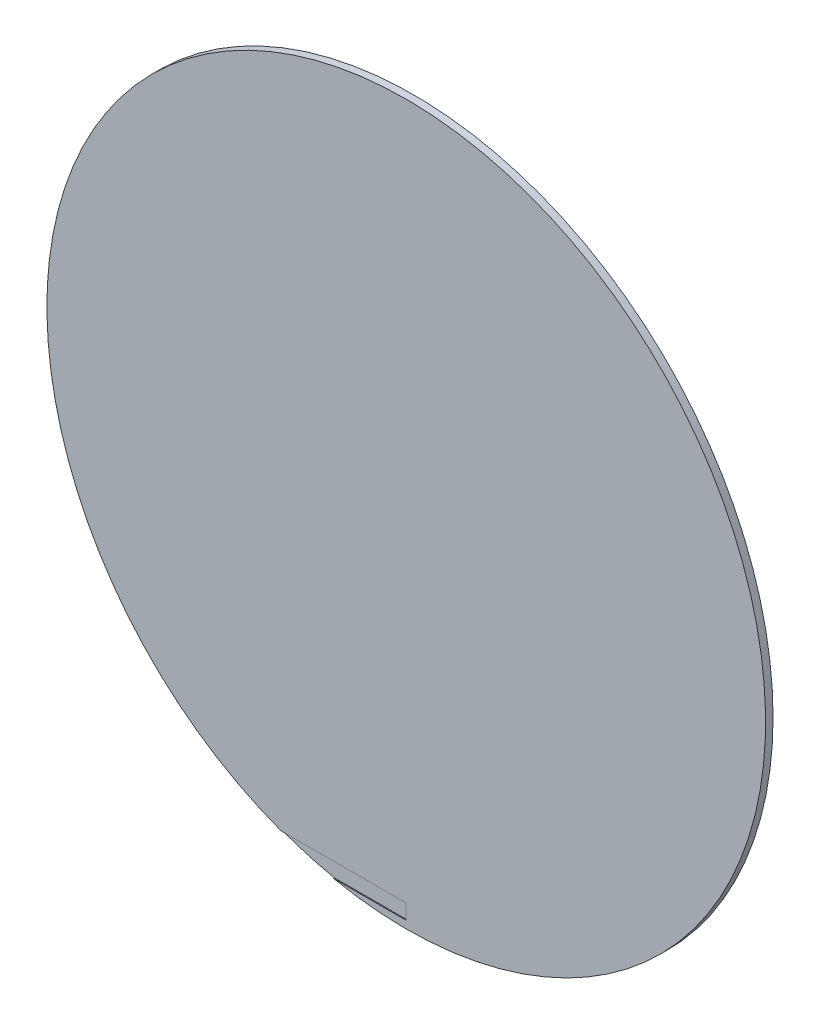
ISO-10303-21;
HEADER;
FILE_DESCRIPTION(('STEP AP214'),'2;1');
FILE_NAME('part.step','',(''),(''),'','','');
FILE_SCHEMA(('AUTOMOTIVE_DESIGN { 1 0 10303 214 1 1 1 1 }'));
ENDSEC;
DATA;
#1=APPLICATION_CONTEXT('core data for automotive mechanical design processes');
#2=APPLICATION_PROTOCOL_DEFINITION('international standard','automotive_design',2000,#1);
#3=PRODUCT_CONTEXT('',#1,'mechanical');
#4=PRODUCT('Part','Part','',(#3));
#5=PRODUCT_RELATED_PRODUCT_CATEGORY('part','',(#4));
#6=PRODUCT_DEFINITION_FORMATION('','',#4);
#7=PRODUCT_DEFINITION_CONTEXT('part definition',#1,'design');
#8=PRODUCT_DEFINITION('design','',#6,#7);
#9=PRODUCT_DEFINITION_SHAPE('','',#8);
#10=(LENGTH_UNIT() NAMED_UNIT(*) SI_UNIT(.MILLI.,.METRE.));
#11=(NAMED_UNIT(*) PLANE_ANGLE_UNIT() SI_UNIT($,.RADIAN.));
#12=(NAMED_UNIT(*) SI_UNIT($,.STERADIAN.) SOLID_ANGLE_UNIT());
#13=UNCERTAINTY_MEASURE_WITH_UNIT(LENGTH_MEASURE(1.E-05),#10,'distance_accuracy_value','');
#14=(GEOMETRIC_REPRESENTATION_CONTEXT(3) GLOBAL_UNCERTAINTY_ASSIGNED_CONTEXT((#13)) GLOBAL_UNIT_ASSIGNED_CONTEXT((#10,
#11,#12)) REPRESENTATION_CONTEXT('',''));
#15=CARTESIAN_POINT('',(0.,0.,0.));
#16=DIRECTION('',(0.,0.,1.));
#17=DIRECTION('',(1.,0.,0.));
#18=AXIS2_PLACEMENT_3D('',#15,#16,#17);
#19=CARTESIAN_POINT('',(0.,0.,3.175));
#20=DIRECTION('',(0.,0.,-1.));
#21=DIRECTION('',(-1.,0.,0.));
#22=AXIS2_PLACEMENT_3D('',#19,#20,#21);
#23=CYLINDRICAL_SURFACE('',#22,152.4);
#24=CARTESIAN_POINT('',(0.,0.,0.));
#25=DIRECTION('',(0.,0.,1.));
#26=DIRECTION('',(1.,0.,0.));
#27=AXIS2_PLACEMENT_3D('',#24,#25,#26);
#28=CIRCLE('',#27,152.4);
#29=CARTESIAN_POINT('',(152.4,0.,0.));
#30=VERTEX_POINT('',#29);
#31=EDGE_CURVE('E100',#30,#30,#28,.T.);
#32=ORIENTED_EDGE('',*,*,#31,.T.);
#33=EDGE_LOOP('',(#32));
#34=FACE_BOUND('',#33,.T.);
#35=DIRECTION('',(0.,0.,-1.));
#36=VECTOR('',#35,1.);
#37=CARTESIAN_POINT('',(-30.9460720447685,-149.225,3.175));
#38=LINE('',#37,#36);
#39=CARTESIAN_POINT('',(-30.9460720447685,-149.225,2.778125));
#40=VERTEX_POINT('',#39);
#41=CARTESIAN_POINT('',(-30.9460720447685,-149.225,3.175));
#42=VERTEX_POINT('',#41);
#43=EDGE_CURVE('E98',#40,#42,#38,.F.);
#44=ORIENTED_EDGE('',*,*,#43,.F.);
#45=CARTESIAN_POINT('',(0.,0.,2.778125));
#46=DIRECTION('',(0.,0.,1.));
#47=DIRECTION('',(1.,0.,0.));
#48=AXIS2_PLACEMENT_3D('',#45,#46,#47);
#49=CIRCLE('',#48,152.4);
#50=CARTESIAN_POINT('',(-53.032955555956,-142.875,2.778125));
#51=VERTEX_POINT('',#50);
#52=EDGE_CURVE('E11',#51,#40,#49,.T.);
#53=ORIENTED_EDGE('',*,*,#52,.F.);
#54=DIRECTION('',(0.,0.,-1.));
#55=VECTOR('',#54,1.);
#56=CARTESIAN_POINT('',(-53.032955555956,-142.875,3.175));
#57=LINE('',#56,#55);
#58=CARTESIAN_POINT('',(-53.032955555956,-142.875,3.175));
#59=VERTEX_POINT('',#58);
#60=EDGE_CURVE('E78',#59,#51,#57,.T.);
#61=ORIENTED_EDGE('',*,*,#60,.F.);
#62=CARTESIAN_POINT('',(0.,0.,3.175));
#63=DIRECTION('',(0.,0.,1.));
#64=DIRECTION('',(1.,0.,0.));
#65=AXIS2_PLACEMENT_3D('',#62,#63,#64);
#66=CIRCLE('',#65,152.4);
#67=EDGE_CURVE('E101',#42,#59,#66,.T.);
#68=ORIENTED_EDGE('',*,*,#67,.F.);
#69=EDGE_LOOP('',(#44,#53,#61,#68));
#70=FACE_BOUND('',#69,.T.);
#71=ADVANCED_FACE('F33',(#34,#70),#23,.T.);
#72=CARTESIAN_POINT('',(0.,0.,3.175));
#73=DIRECTION('',(0.,0.,1.));
#74=DIRECTION('',(1.,0.,0.));
#75=AXIS2_PLACEMENT_3D('',#72,#73,#74);
#76=PLANE('',#75);
#77=DIRECTION('',(0.,-1.,0.));
#78=VECTOR('',#77,1.);
#79=CARTESIAN_POINT('',(0.,-149.225,3.175));
#80=LINE('',#79,#78);
#81=CARTESIAN_POINT('',(0.,-142.875,3.175));
#82=VERTEX_POINT('',#81);
#83=CARTESIAN_POINT('',(0.,-149.225,3.175));
#84=VERTEX_POINT('',#83);
#85=EDGE_CURVE('E86',#82,#84,#80,.T.);
#86=ORIENTED_EDGE('',*,*,#85,.T.);
#87=DIRECTION('',(-1.,0.,0.));
#88=VECTOR('',#87,1.);
#89=CARTESIAN_POINT('',(-117.66951062511,-149.225,3.175));
#90=LINE('',#89,#88);
#91=EDGE_CURVE('E47',#84,#42,#90,.T.);
#92=ORIENTED_EDGE('',*,*,#91,.T.);
#93=ORIENTED_EDGE('',*,*,#67,.T.);
#94=DIRECTION('',(1.,0.,0.));
#95=VECTOR('',#94,1.);
#96=CARTESIAN_POINT('',(0.,-142.875,3.175));
#97=LINE('',#96,#95);
#98=EDGE_CURVE('E40',#59,#82,#97,.T.);
#99=ORIENTED_EDGE('',*,*,#98,.T.);
#100=EDGE_LOOP('',(#86,#92,#93,#99));
#101=FACE_BOUND('',#100,.T.);
#102=ADVANCED_FACE('F106',(#101),#76,.T.);
#103=CARTESIAN_POINT('',(0.,0.,0.));
#104=DIRECTION('',(0.,0.,1.));
#105=DIRECTION('',(1.,0.,0.));
#106=AXIS2_PLACEMENT_3D('',#103,#104,#105);
#107=PLANE('',#106);
#108=ORIENTED_EDGE('',*,*,#31,.F.);
#109=EDGE_LOOP('',(#108));
#110=FACE_BOUND('',#109,.T.);
#111=ADVANCED_FACE('F118',(#110),#107,.F.);
#112=CARTESIAN_POINT('',(0.,0.,2.778125));
#113=DIRECTION('',(0.,0.,1.));
#114=DIRECTION('',(1.,0.,0.));
#115=AXIS2_PLACEMENT_3D('',#112,#113,#114);
#116=PLANE('',#115);
#117=ORIENTED_EDGE('',*,*,#52,.T.);
#118=DIRECTION('',(-1.,0.,0.));
#119=VECTOR('',#118,1.);
#120=CARTESIAN_POINT('',(-117.66951062511,-149.225,2.778125));
#121=LINE('',#120,#119);
#122=CARTESIAN_POINT('',(0.,-149.225,2.778125));
#123=VERTEX_POINT('',#122);
#124=EDGE_CURVE('E81',#123,#40,#121,.T.);
#125=ORIENTED_EDGE('',*,*,#124,.F.);
#126=DIRECTION('',(0.,-1.,0.));
#127=VECTOR('',#126,1.);
#128=CARTESIAN_POINT('',(0.,-149.225,2.778125));
#129=LINE('',#128,#127);
#130=CARTESIAN_POINT('',(0.,-142.875,2.778125));
#131=VERTEX_POINT('',#130);
#132=EDGE_CURVE('E80',#131,#123,#129,.T.);
#133=ORIENTED_EDGE('',*,*,#132,.F.);
#134=DIRECTION('',(1.,0.,0.));
#135=VECTOR('',#134,1.);
#136=CARTESIAN_POINT('',(0.,-142.875,2.778125));
#137=LINE('',#136,#135);
#138=EDGE_CURVE('E72',#51,#131,#137,.T.);
#139=ORIENTED_EDGE('',*,*,#138,.F.);
#140=EDGE_LOOP('',(#117,#125,#133,#139));
#141=FACE_BOUND('',#140,.T.);
#142=ADVANCED_FACE('F90',(#141),#116,.T.);
#143=CARTESIAN_POINT('',(-117.66951062511,-149.225,2.778125));
#144=DIRECTION('',(0.,1.,0.));
#145=DIRECTION('',(-1.,0.,0.));
#146=AXIS2_PLACEMENT_3D('',#143,#144,#145);
#147=PLANE('',#146);
#148=ORIENTED_EDGE('',*,*,#43,.T.);
#149=ORIENTED_EDGE('',*,*,#91,.F.);
#150=DIRECTION('',(0.,0.,1.));
#151=VECTOR('',#150,1.);
#152=CARTESIAN_POINT('',(0.,-149.225,2.778125));
#153=LINE('',#152,#151);
#154=EDGE_CURVE('E88',#123,#84,#153,.T.);
#155=ORIENTED_EDGE('',*,*,#154,.F.);
#156=ORIENTED_EDGE('',*,*,#124,.T.);
#157=EDGE_LOOP('',(#148,#149,#155,#156));
#158=FACE_BOUND('',#157,.T.);
#159=ADVANCED_FACE('F110',(#158),#147,.T.);
#160=CARTESIAN_POINT('',(0.,-142.875,2.778125));
#161=DIRECTION('',(0.,-1.,0.));
#162=DIRECTION('',(0.,0.,-1.));
#163=AXIS2_PLACEMENT_3D('',#160,#161,#162);
#164=PLANE('',#163);
#165=ORIENTED_EDGE('',*,*,#60,.T.);
#166=ORIENTED_EDGE('',*,*,#138,.T.);
#167=DIRECTION('',(0.,0.,1.));
#168=VECTOR('',#167,1.);
#169=CARTESIAN_POINT('',(0.,-142.875,2.778125));
#170=LINE('',#169,#168);
#171=EDGE_CURVE('E75',#131,#82,#170,.T.);
#172=ORIENTED_EDGE('',*,*,#171,.T.);
#173=ORIENTED_EDGE('',*,*,#98,.F.);
#174=EDGE_LOOP('',(#165,#166,#172,#173));
#175=FACE_BOUND('',#174,.T.);
#176=ADVANCED_FACE('F74',(#175),#164,.T.);
#177=CARTESIAN_POINT('',(0.,-149.225,2.778125));
#178=DIRECTION('',(-1.,0.,0.));
#179=DIRECTION('',(0.,-1.,0.));
#180=AXIS2_PLACEMENT_3D('',#177,#178,#179);
#181=PLANE('',#180);
#182=ORIENTED_EDGE('',*,*,#85,.F.);
#183=ORIENTED_EDGE('',*,*,#171,.F.);
#184=ORIENTED_EDGE('',*,*,#132,.T.);
#185=ORIENTED_EDGE('',*,*,#154,.T.);
#186=EDGE_LOOP('',(#182,#183,#184,#185));
#187=FACE_BOUND('',#186,.T.);
#188=ADVANCED_FACE('F84',(#187),#181,.T.);
#189=CLOSED_SHELL('',(#71,#102,#111,#142,#159,#176,#188));
#190=MANIFOLD_SOLID_BREP('B2',#189);
#191=ADVANCED_BREP_SHAPE_REPRESENTATION('',(#18,#190),#14);
#192=SHAPE_DEFINITION_REPRESENTATION(#9,#191);
ENDSEC;
END-ISO-10303-21;
